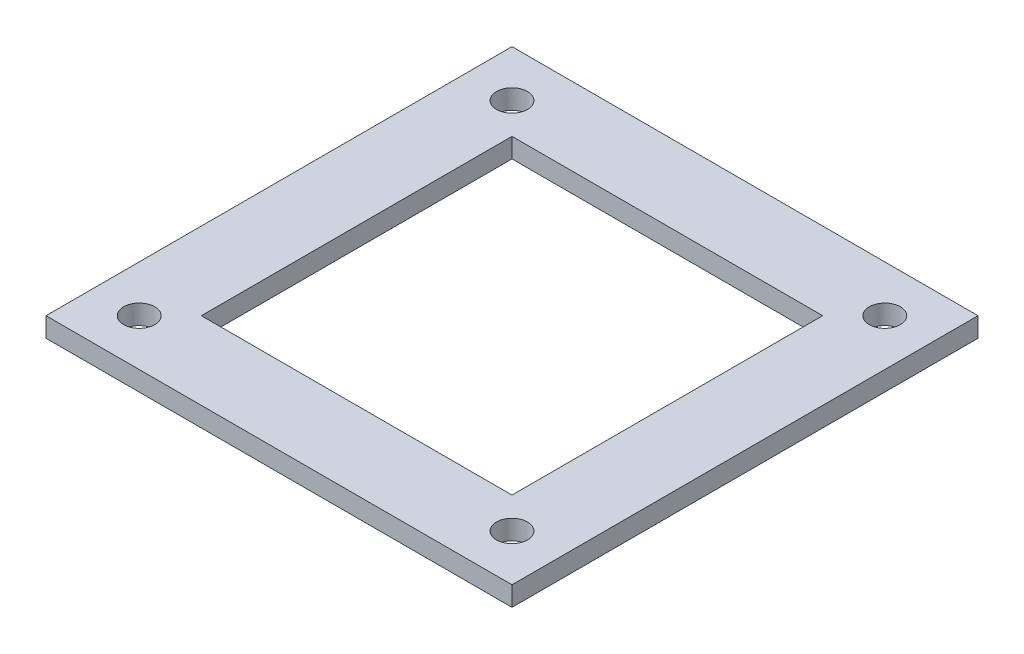
ISO-10303-21;
HEADER;
FILE_DESCRIPTION(('STEP AP214'),'2;1');
FILE_NAME('part.step','',(''),(''),'','','');
FILE_SCHEMA(('AUTOMOTIVE_DESIGN { 1 0 10303 214 1 1 1 1 }'));
ENDSEC;
DATA;
#1=APPLICATION_CONTEXT('core data for automotive mechanical design processes');
#2=APPLICATION_PROTOCOL_DEFINITION('international standard','automotive_design',2000,#1);
#3=PRODUCT_CONTEXT('',#1,'mechanical');
#4=PRODUCT('Part','Part','',(#3));
#5=PRODUCT_RELATED_PRODUCT_CATEGORY('part','',(#4));
#6=PRODUCT_DEFINITION_FORMATION('','',#4);
#7=PRODUCT_DEFINITION_CONTEXT('part definition',#1,'design');
#8=PRODUCT_DEFINITION('design','',#6,#7);
#9=PRODUCT_DEFINITION_SHAPE('','',#8);
#10=(LENGTH_UNIT() NAMED_UNIT(*) SI_UNIT(.MILLI.,.METRE.));
#11=(NAMED_UNIT(*) PLANE_ANGLE_UNIT() SI_UNIT($,.RADIAN.));
#12=(NAMED_UNIT(*) SI_UNIT($,.STERADIAN.) SOLID_ANGLE_UNIT());
#13=UNCERTAINTY_MEASURE_WITH_UNIT(LENGTH_MEASURE(1.E-05),#10,'distance_accuracy_value','');
#14=(GEOMETRIC_REPRESENTATION_CONTEXT(3) GLOBAL_UNCERTAINTY_ASSIGNED_CONTEXT((#13)) GLOBAL_UNIT_ASSIGNED_CONTEXT((#10,
#11,#12)) REPRESENTATION_CONTEXT('',''));
#15=CARTESIAN_POINT('',(0.,0.,0.));
#16=DIRECTION('',(0.,0.,1.));
#17=DIRECTION('',(1.,0.,0.));
#18=AXIS2_PLACEMENT_3D('',#15,#16,#17);
#19=CARTESIAN_POINT('',(0.,4.,0.));
#20=DIRECTION('',(0.,1.,0.));
#21=DIRECTION('',(0.,0.,1.));
#22=AXIS2_PLACEMENT_3D('',#19,#20,#21);
#23=PLANE('',#22);
#24=CARTESIAN_POINT('',(38.1,4.,38.1));
#25=DIRECTION('',(0.,1.,0.));
#26=DIRECTION('',(0.,0.,1.));
#27=AXIS2_PLACEMENT_3D('',#24,#25,#26);
#28=CIRCLE('',#27,3.17500000000001);
#29=CARTESIAN_POINT('',(38.1,4.,41.275));
#30=VERTEX_POINT('',#29);
#31=EDGE_CURVE('E143',#30,#30,#28,.T.);
#32=ORIENTED_EDGE('',*,*,#31,.F.);
#33=EDGE_LOOP('',(#32));
#34=FACE_BOUND('',#33,.T.);
#35=CARTESIAN_POINT('',(-38.1,4.,-38.1));
#36=DIRECTION('',(0.,1.,0.));
#37=DIRECTION('',(0.,0.,1.));
#38=AXIS2_PLACEMENT_3D('',#35,#36,#37);
#39=CIRCLE('',#38,3.17500000000001);
#40=CARTESIAN_POINT('',(-38.1,4.,-34.925));
#41=VERTEX_POINT('',#40);
#42=EDGE_CURVE('E155',#41,#41,#39,.T.);
#43=ORIENTED_EDGE('',*,*,#42,.F.);
#44=EDGE_LOOP('',(#43));
#45=FACE_BOUND('',#44,.T.);
#46=DIRECTION('',(0.,0.,1.));
#47=VECTOR('',#46,1.);
#48=CARTESIAN_POINT('',(-47.625,4.,47.625));
#49=LINE('',#48,#47);
#50=CARTESIAN_POINT('',(-47.625,4.,-47.625));
#51=VERTEX_POINT('',#50);
#52=CARTESIAN_POINT('',(-47.625,4.,47.625));
#53=VERTEX_POINT('',#52);
#54=EDGE_CURVE('E161',#51,#53,#49,.T.);
#55=ORIENTED_EDGE('',*,*,#54,.T.);
#56=DIRECTION('',(1.,0.,0.));
#57=VECTOR('',#56,1.);
#58=CARTESIAN_POINT('',(47.625,4.,47.625));
#59=LINE('',#58,#57);
#60=CARTESIAN_POINT('',(47.625,4.,47.625));
#61=VERTEX_POINT('',#60);
#62=EDGE_CURVE('E164',#53,#61,#59,.T.);
#63=ORIENTED_EDGE('',*,*,#62,.T.);
#64=DIRECTION('',(0.,0.,-1.));
#65=VECTOR('',#64,1.);
#66=CARTESIAN_POINT('',(47.625,4.,47.625));
#67=LINE('',#66,#65);
#68=CARTESIAN_POINT('',(47.625,4.,-47.625));
#69=VERTEX_POINT('',#68);
#70=EDGE_CURVE('E167',#61,#69,#67,.T.);
#71=ORIENTED_EDGE('',*,*,#70,.T.);
#72=DIRECTION('',(-1.,0.,0.));
#73=VECTOR('',#72,1.);
#74=CARTESIAN_POINT('',(47.625,4.,-47.625));
#75=LINE('',#74,#73);
#76=EDGE_CURVE('E169',#69,#51,#75,.T.);
#77=ORIENTED_EDGE('',*,*,#76,.T.);
#78=EDGE_LOOP('',(#55,#63,#71,#77));
#79=FACE_BOUND('',#78,.T.);
#80=CARTESIAN_POINT('',(38.1,4.,-38.1));
#81=DIRECTION('',(0.,1.,0.));
#82=DIRECTION('',(0.,0.,1.));
#83=AXIS2_PLACEMENT_3D('',#80,#81,#82);
#84=CIRCLE('',#83,3.17500000000001);
#85=CARTESIAN_POINT('',(38.1,4.,-34.925));
#86=VERTEX_POINT('',#85);
#87=EDGE_CURVE('E149',#86,#86,#84,.T.);
#88=ORIENTED_EDGE('',*,*,#87,.F.);
#89=EDGE_LOOP('',(#88));
#90=FACE_BOUND('',#89,.T.);
#91=CARTESIAN_POINT('',(-38.1,4.,38.1));
#92=DIRECTION('',(0.,1.,0.));
#93=DIRECTION('',(0.,0.,1.));
#94=AXIS2_PLACEMENT_3D('',#91,#92,#93);
#95=CIRCLE('',#94,3.17500000000001);
#96=CARTESIAN_POINT('',(-38.1,4.,41.275));
#97=VERTEX_POINT('',#96);
#98=EDGE_CURVE('E137',#97,#97,#95,.T.);
#99=ORIENTED_EDGE('',*,*,#98,.F.);
#100=EDGE_LOOP('',(#99));
#101=FACE_BOUND('',#100,.T.);
#102=DIRECTION('',(1.,0.,0.));
#103=VECTOR('',#102,1.);
#104=CARTESIAN_POINT('',(31.75,4.,31.75));
#105=LINE('',#104,#103);
#106=CARTESIAN_POINT('',(-31.75,4.,31.75));
#107=VERTEX_POINT('',#106);
#108=CARTESIAN_POINT('',(31.75,4.,31.75));
#109=VERTEX_POINT('',#108);
#110=EDGE_CURVE('E109',#107,#109,#105,.T.);
#111=ORIENTED_EDGE('',*,*,#110,.F.);
#112=DIRECTION('',(0.,0.,1.));
#113=VECTOR('',#112,1.);
#114=CARTESIAN_POINT('',(-31.75,4.,31.75));
#115=LINE('',#114,#113);
#116=CARTESIAN_POINT('',(-31.75,4.,-31.75));
#117=VERTEX_POINT('',#116);
#118=EDGE_CURVE('E101',#117,#107,#115,.T.);
#119=ORIENTED_EDGE('',*,*,#118,.F.);
#120=DIRECTION('',(-1.,0.,0.));
#121=VECTOR('',#120,1.);
#122=CARTESIAN_POINT('',(31.75,4.,-31.75));
#123=LINE('',#122,#121);
#124=CARTESIAN_POINT('',(31.75,4.,-31.75));
#125=VERTEX_POINT('',#124);
#126=EDGE_CURVE('E123',#125,#117,#123,.T.);
#127=ORIENTED_EDGE('',*,*,#126,.F.);
#128=DIRECTION('',(0.,0.,-1.));
#129=VECTOR('',#128,1.);
#130=CARTESIAN_POINT('',(31.75,4.,31.75));
#131=LINE('',#130,#129);
#132=EDGE_CURVE('E121',#109,#125,#131,.T.);
#133=ORIENTED_EDGE('',*,*,#132,.F.);
#134=EDGE_LOOP('',(#111,#119,#127,#133));
#135=FACE_BOUND('',#134,.T.);
#136=ADVANCED_FACE('F36',(#34,#45,#79,#90,#101,#135),#23,.T.);
#137=CARTESIAN_POINT('',(0.,0.,0.));
#138=DIRECTION('',(0.,1.,0.));
#139=DIRECTION('',(0.,0.,1.));
#140=AXIS2_PLACEMENT_3D('',#137,#138,#139);
#141=PLANE('',#140);
#142=CARTESIAN_POINT('',(-38.1,0.,38.1));
#143=DIRECTION('',(0.,1.,0.));
#144=DIRECTION('',(0.,0.,1.));
#145=AXIS2_PLACEMENT_3D('',#142,#143,#144);
#146=CIRCLE('',#145,3.17500000000001);
#147=CARTESIAN_POINT('',(-38.1,0.,41.275));
#148=VERTEX_POINT('',#147);
#149=EDGE_CURVE('E117',#148,#148,#146,.T.);
#150=ORIENTED_EDGE('',*,*,#149,.T.);
#151=EDGE_LOOP('',(#150));
#152=FACE_BOUND('',#151,.T.);
#153=CARTESIAN_POINT('',(38.1,0.,38.1));
#154=DIRECTION('',(0.,1.,0.));
#155=DIRECTION('',(0.,0.,1.));
#156=AXIS2_PLACEMENT_3D('',#153,#154,#155);
#157=CIRCLE('',#156,3.17500000000001);
#158=CARTESIAN_POINT('',(38.1,0.,41.275));
#159=VERTEX_POINT('',#158);
#160=EDGE_CURVE('E140',#159,#159,#157,.T.);
#161=ORIENTED_EDGE('',*,*,#160,.T.);
#162=EDGE_LOOP('',(#161));
#163=FACE_BOUND('',#162,.T.);
#164=CARTESIAN_POINT('',(38.1,0.,-38.1));
#165=DIRECTION('',(0.,1.,0.));
#166=DIRECTION('',(0.,0.,1.));
#167=AXIS2_PLACEMENT_3D('',#164,#165,#166);
#168=CIRCLE('',#167,3.17500000000001);
#169=CARTESIAN_POINT('',(38.1,0.,-34.925));
#170=VERTEX_POINT('',#169);
#171=EDGE_CURVE('E146',#170,#170,#168,.T.);
#172=ORIENTED_EDGE('',*,*,#171,.T.);
#173=EDGE_LOOP('',(#172));
#174=FACE_BOUND('',#173,.T.);
#175=CARTESIAN_POINT('',(-38.1,0.,-38.1));
#176=DIRECTION('',(0.,1.,0.));
#177=DIRECTION('',(0.,0.,1.));
#178=AXIS2_PLACEMENT_3D('',#175,#176,#177);
#179=CIRCLE('',#178,3.17500000000001);
#180=CARTESIAN_POINT('',(-38.1,0.,-34.925));
#181=VERTEX_POINT('',#180);
#182=EDGE_CURVE('E152',#181,#181,#179,.T.);
#183=ORIENTED_EDGE('',*,*,#182,.T.);
#184=EDGE_LOOP('',(#183));
#185=FACE_BOUND('',#184,.T.);
#186=DIRECTION('',(0.,0.,1.));
#187=VECTOR('',#186,1.);
#188=CARTESIAN_POINT('',(-47.625,0.,47.625));
#189=LINE('',#188,#187);
#190=CARTESIAN_POINT('',(-47.625,0.,-47.625));
#191=VERTEX_POINT('',#190);
#192=CARTESIAN_POINT('',(-47.625,0.,47.625));
#193=VERTEX_POINT('',#192);
#194=EDGE_CURVE('E158',#191,#193,#189,.T.);
#195=ORIENTED_EDGE('',*,*,#194,.F.);
#196=DIRECTION('',(-1.,0.,0.));
#197=VECTOR('',#196,1.);
#198=CARTESIAN_POINT('',(47.625,0.,-47.625));
#199=LINE('',#198,#197);
#200=CARTESIAN_POINT('',(47.625,0.,-47.625));
#201=VERTEX_POINT('',#200);
#202=EDGE_CURVE('E165',#201,#191,#199,.T.);
#203=ORIENTED_EDGE('',*,*,#202,.F.);
#204=DIRECTION('',(0.,0.,-1.));
#205=VECTOR('',#204,1.);
#206=CARTESIAN_POINT('',(47.625,0.,47.625));
#207=LINE('',#206,#205);
#208=CARTESIAN_POINT('',(47.625,0.,47.625));
#209=VERTEX_POINT('',#208);
#210=EDGE_CURVE('E176',#209,#201,#207,.T.);
#211=ORIENTED_EDGE('',*,*,#210,.F.);
#212=DIRECTION('',(1.,0.,0.));
#213=VECTOR('',#212,1.);
#214=CARTESIAN_POINT('',(47.625,0.,47.625));
#215=LINE('',#214,#213);
#216=EDGE_CURVE('E174',#193,#209,#215,.T.);
#217=ORIENTED_EDGE('',*,*,#216,.F.);
#218=EDGE_LOOP('',(#195,#203,#211,#217));
#219=FACE_BOUND('',#218,.T.);
#220=DIRECTION('',(0.,0.,1.));
#221=VECTOR('',#220,1.);
#222=CARTESIAN_POINT('',(-31.75,0.,31.75));
#223=LINE('',#222,#221);
#224=CARTESIAN_POINT('',(-31.75,0.,-31.75));
#225=VERTEX_POINT('',#224);
#226=CARTESIAN_POINT('',(-31.75,0.,31.75));
#227=VERTEX_POINT('',#226);
#228=EDGE_CURVE('E59',#225,#227,#223,.T.);
#229=ORIENTED_EDGE('',*,*,#228,.T.);
#230=DIRECTION('',(1.,0.,0.));
#231=VECTOR('',#230,1.);
#232=CARTESIAN_POINT('',(31.75,0.,31.75));
#233=LINE('',#232,#231);
#234=CARTESIAN_POINT('',(31.75,0.,31.75));
#235=VERTEX_POINT('',#234);
#236=EDGE_CURVE('E116',#227,#235,#233,.T.);
#237=ORIENTED_EDGE('',*,*,#236,.T.);
#238=DIRECTION('',(0.,0.,-1.));
#239=VECTOR('',#238,1.);
#240=CARTESIAN_POINT('',(31.75,0.,31.75));
#241=LINE('',#240,#239);
#242=CARTESIAN_POINT('',(31.75,0.,-31.75));
#243=VERTEX_POINT('',#242);
#244=EDGE_CURVE('E129',#235,#243,#241,.T.);
#245=ORIENTED_EDGE('',*,*,#244,.T.);
#246=DIRECTION('',(-1.,0.,0.));
#247=VECTOR('',#246,1.);
#248=CARTESIAN_POINT('',(31.75,0.,-31.75));
#249=LINE('',#248,#247);
#250=EDGE_CURVE('E110',#243,#225,#249,.T.);
#251=ORIENTED_EDGE('',*,*,#250,.T.);
#252=EDGE_LOOP('',(#229,#237,#245,#251));
#253=FACE_BOUND('',#252,.T.);
#254=ADVANCED_FACE('F194',(#152,#163,#174,#185,#219,#253),#141,.F.);
#255=CARTESIAN_POINT('',(-47.625,4.,47.625));
#256=DIRECTION('',(1.,0.,0.));
#257=DIRECTION('',(0.,0.,-1.));
#258=AXIS2_PLACEMENT_3D('',#255,#256,#257);
#259=PLANE('',#258);
#260=ORIENTED_EDGE('',*,*,#194,.T.);
#261=DIRECTION('',(0.,-1.,0.));
#262=VECTOR('',#261,1.);
#263=CARTESIAN_POINT('',(-47.625,4.,47.625));
#264=LINE('',#263,#262);
#265=EDGE_CURVE('E11',#53,#193,#264,.T.);
#266=ORIENTED_EDGE('',*,*,#265,.F.);
#267=ORIENTED_EDGE('',*,*,#54,.F.);
#268=DIRECTION('',(0.,-1.,0.));
#269=VECTOR('',#268,1.);
#270=CARTESIAN_POINT('',(-47.625,4.,-47.625));
#271=LINE('',#270,#269);
#272=EDGE_CURVE('E171',#51,#191,#271,.T.);
#273=ORIENTED_EDGE('',*,*,#272,.T.);
#274=EDGE_LOOP('',(#260,#266,#267,#273));
#275=FACE_BOUND('',#274,.T.);
#276=ADVANCED_FACE('F38',(#275),#259,.F.);
#277=CARTESIAN_POINT('',(47.625,4.,47.625));
#278=DIRECTION('',(0.,0.,-1.));
#279=DIRECTION('',(-1.,0.,0.));
#280=AXIS2_PLACEMENT_3D('',#277,#278,#279);
#281=PLANE('',#280);
#282=ORIENTED_EDGE('',*,*,#216,.T.);
#283=DIRECTION('',(0.,-1.,0.));
#284=VECTOR('',#283,1.);
#285=CARTESIAN_POINT('',(47.625,4.,47.625));
#286=LINE('',#285,#284);
#287=EDGE_CURVE('E44',#61,#209,#286,.T.);
#288=ORIENTED_EDGE('',*,*,#287,.F.);
#289=ORIENTED_EDGE('',*,*,#62,.F.);
#290=ORIENTED_EDGE('',*,*,#265,.T.);
#291=EDGE_LOOP('',(#282,#288,#289,#290));
#292=FACE_BOUND('',#291,.T.);
#293=ADVANCED_FACE('F205',(#292),#281,.F.);
#294=CARTESIAN_POINT('',(47.625,4.,47.625));
#295=DIRECTION('',(-1.,0.,0.));
#296=DIRECTION('',(0.,0.,1.));
#297=AXIS2_PLACEMENT_3D('',#294,#295,#296);
#298=PLANE('',#297);
#299=ORIENTED_EDGE('',*,*,#210,.T.);
#300=DIRECTION('',(0.,-1.,0.));
#301=VECTOR('',#300,1.);
#302=CARTESIAN_POINT('',(47.625,4.,-47.625));
#303=LINE('',#302,#301);
#304=EDGE_CURVE('E181',#69,#201,#303,.T.);
#305=ORIENTED_EDGE('',*,*,#304,.F.);
#306=ORIENTED_EDGE('',*,*,#70,.F.);
#307=ORIENTED_EDGE('',*,*,#287,.T.);
#308=EDGE_LOOP('',(#299,#305,#306,#307));
#309=FACE_BOUND('',#308,.T.);
#310=ADVANCED_FACE('F188',(#309),#298,.F.);
#311=CARTESIAN_POINT('',(47.625,4.,-47.625));
#312=DIRECTION('',(0.,0.,1.));
#313=DIRECTION('',(1.,0.,0.));
#314=AXIS2_PLACEMENT_3D('',#311,#312,#313);
#315=PLANE('',#314);
#316=ORIENTED_EDGE('',*,*,#202,.T.);
#317=ORIENTED_EDGE('',*,*,#272,.F.);
#318=ORIENTED_EDGE('',*,*,#76,.F.);
#319=ORIENTED_EDGE('',*,*,#304,.T.);
#320=EDGE_LOOP('',(#316,#317,#318,#319));
#321=FACE_BOUND('',#320,.T.);
#322=ADVANCED_FACE('F198',(#321),#315,.F.);
#323=CARTESIAN_POINT('',(-38.1,4.,-38.1));
#324=DIRECTION('',(0.,-1.,0.));
#325=DIRECTION('',(0.,0.,-1.));
#326=AXIS2_PLACEMENT_3D('',#323,#324,#325);
#327=CYLINDRICAL_SURFACE('',#326,3.17500000000001);
#328=ORIENTED_EDGE('',*,*,#42,.T.);
#329=EDGE_LOOP('',(#328));
#330=FACE_BOUND('',#329,.T.);
#331=ORIENTED_EDGE('',*,*,#182,.F.);
#332=EDGE_LOOP('',(#331));
#333=FACE_BOUND('',#332,.T.);
#334=ADVANCED_FACE('F223',(#330,#333),#327,.F.);
#335=CARTESIAN_POINT('',(38.1,4.,-38.1));
#336=DIRECTION('',(0.,-1.,0.));
#337=DIRECTION('',(0.,0.,-1.));
#338=AXIS2_PLACEMENT_3D('',#335,#336,#337);
#339=CYLINDRICAL_SURFACE('',#338,3.17500000000001);
#340=ORIENTED_EDGE('',*,*,#87,.T.);
#341=EDGE_LOOP('',(#340));
#342=FACE_BOUND('',#341,.T.);
#343=ORIENTED_EDGE('',*,*,#171,.F.);
#344=EDGE_LOOP('',(#343));
#345=FACE_BOUND('',#344,.T.);
#346=ADVANCED_FACE('F230',(#342,#345),#339,.F.);
#347=CARTESIAN_POINT('',(38.1,4.,38.1));
#348=DIRECTION('',(0.,-1.,0.));
#349=DIRECTION('',(0.,0.,-1.));
#350=AXIS2_PLACEMENT_3D('',#347,#348,#349);
#351=CYLINDRICAL_SURFACE('',#350,3.17500000000001);
#352=ORIENTED_EDGE('',*,*,#31,.T.);
#353=EDGE_LOOP('',(#352));
#354=FACE_BOUND('',#353,.T.);
#355=ORIENTED_EDGE('',*,*,#160,.F.);
#356=EDGE_LOOP('',(#355));
#357=FACE_BOUND('',#356,.T.);
#358=ADVANCED_FACE('F235',(#354,#357),#351,.F.);
#359=CARTESIAN_POINT('',(-38.1,4.,38.1));
#360=DIRECTION('',(0.,-1.,0.));
#361=DIRECTION('',(0.,0.,-1.));
#362=AXIS2_PLACEMENT_3D('',#359,#360,#361);
#363=CYLINDRICAL_SURFACE('',#362,3.17500000000001);
#364=ORIENTED_EDGE('',*,*,#98,.T.);
#365=EDGE_LOOP('',(#364));
#366=FACE_BOUND('',#365,.T.);
#367=ORIENTED_EDGE('',*,*,#149,.F.);
#368=EDGE_LOOP('',(#367));
#369=FACE_BOUND('',#368,.T.);
#370=ADVANCED_FACE('F244',(#366,#369),#363,.F.);
#371=CARTESIAN_POINT('',(-31.75,4.,31.75));
#372=DIRECTION('',(1.,0.,0.));
#373=DIRECTION('',(0.,0.,-1.));
#374=AXIS2_PLACEMENT_3D('',#371,#372,#373);
#375=PLANE('',#374);
#376=ORIENTED_EDGE('',*,*,#228,.F.);
#377=DIRECTION('',(0.,-1.,0.));
#378=VECTOR('',#377,1.);
#379=CARTESIAN_POINT('',(-31.75,4.,-31.75));
#380=LINE('',#379,#378);
#381=EDGE_CURVE('E105',#117,#225,#380,.T.);
#382=ORIENTED_EDGE('',*,*,#381,.F.);
#383=ORIENTED_EDGE('',*,*,#118,.T.);
#384=DIRECTION('',(0.,-1.,0.));
#385=VECTOR('',#384,1.);
#386=CARTESIAN_POINT('',(-31.75,4.,31.75));
#387=LINE('',#386,#385);
#388=EDGE_CURVE('E104',#107,#227,#387,.T.);
#389=ORIENTED_EDGE('',*,*,#388,.T.);
#390=EDGE_LOOP('',(#376,#382,#383,#389));
#391=FACE_BOUND('',#390,.T.);
#392=ADVANCED_FACE('F103',(#391),#375,.T.);
#393=CARTESIAN_POINT('',(31.75,4.,31.75));
#394=DIRECTION('',(0.,0.,-1.));
#395=DIRECTION('',(-1.,0.,0.));
#396=AXIS2_PLACEMENT_3D('',#393,#394,#395);
#397=PLANE('',#396);
#398=ORIENTED_EDGE('',*,*,#236,.F.);
#399=ORIENTED_EDGE('',*,*,#388,.F.);
#400=ORIENTED_EDGE('',*,*,#110,.T.);
#401=DIRECTION('',(0.,-1.,0.));
#402=VECTOR('',#401,1.);
#403=CARTESIAN_POINT('',(31.75,4.,31.75));
#404=LINE('',#403,#402);
#405=EDGE_CURVE('E118',#109,#235,#404,.T.);
#406=ORIENTED_EDGE('',*,*,#405,.T.);
#407=EDGE_LOOP('',(#398,#399,#400,#406));
#408=FACE_BOUND('',#407,.T.);
#409=ADVANCED_FACE('F113',(#408),#397,.T.);
#410=CARTESIAN_POINT('',(31.75,4.,31.75));
#411=DIRECTION('',(-1.,0.,0.));
#412=DIRECTION('',(0.,0.,1.));
#413=AXIS2_PLACEMENT_3D('',#410,#411,#412);
#414=PLANE('',#413);
#415=ORIENTED_EDGE('',*,*,#244,.F.);
#416=ORIENTED_EDGE('',*,*,#405,.F.);
#417=ORIENTED_EDGE('',*,*,#132,.T.);
#418=DIRECTION('',(0.,-1.,0.));
#419=VECTOR('',#418,1.);
#420=CARTESIAN_POINT('',(31.75,4.,-31.75));
#421=LINE('',#420,#419);
#422=EDGE_CURVE('E51',#125,#243,#421,.T.);
#423=ORIENTED_EDGE('',*,*,#422,.T.);
#424=EDGE_LOOP('',(#415,#416,#417,#423));
#425=FACE_BOUND('',#424,.T.);
#426=ADVANCED_FACE('F256',(#425),#414,.T.);
#427=CARTESIAN_POINT('',(31.75,4.,-31.75));
#428=DIRECTION('',(0.,0.,1.));
#429=DIRECTION('',(1.,0.,0.));
#430=AXIS2_PLACEMENT_3D('',#427,#428,#429);
#431=PLANE('',#430);
#432=ORIENTED_EDGE('',*,*,#250,.F.);
#433=ORIENTED_EDGE('',*,*,#422,.F.);
#434=ORIENTED_EDGE('',*,*,#126,.T.);
#435=ORIENTED_EDGE('',*,*,#381,.T.);
#436=EDGE_LOOP('',(#432,#433,#434,#435));
#437=FACE_BOUND('',#436,.T.);
#438=ADVANCED_FACE('F259',(#437),#431,.T.);
#439=CLOSED_SHELL('',(#136,#254,#276,#293,#310,#322,#334,#346,#358,#370,#392,#409,#426,#438));
#440=MANIFOLD_SOLID_BREP('B2',#439);
#441=ADVANCED_BREP_SHAPE_REPRESENTATION('',(#18,#440),#14);
#442=SHAPE_DEFINITION_REPRESENTATION(#9,#441);
ENDSEC;
END-ISO-10303-21;
